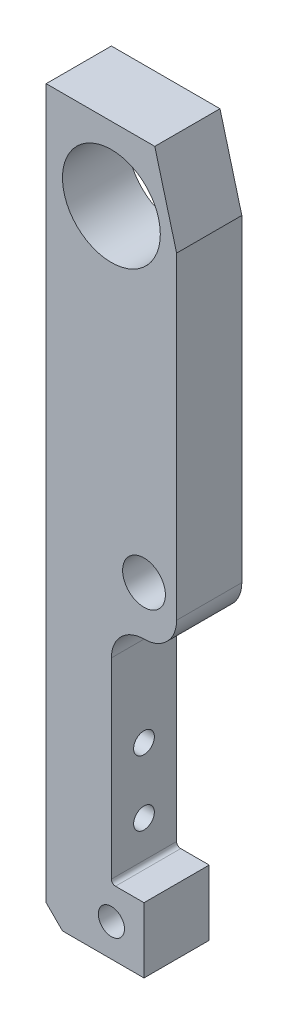
ISO-10303-21;
HEADER;
FILE_DESCRIPTION(('STEP AP214'),'2;1');
FILE_NAME('part.step','',(''),(''),'','','');
FILE_SCHEMA(('AUTOMOTIVE_DESIGN { 1 0 10303 214 1 1 1 1 }'));
ENDSEC;
DATA;
#1=APPLICATION_CONTEXT('core data for automotive mechanical design processes');
#2=APPLICATION_PROTOCOL_DEFINITION('international standard','automotive_design',2000,#1);
#3=PRODUCT_CONTEXT('',#1,'mechanical');
#4=PRODUCT('Part','Part','',(#3));
#5=PRODUCT_RELATED_PRODUCT_CATEGORY('part','',(#4));
#6=PRODUCT_DEFINITION_FORMATION('','',#4);
#7=PRODUCT_DEFINITION_CONTEXT('part definition',#1,'design');
#8=PRODUCT_DEFINITION('design','',#6,#7);
#9=PRODUCT_DEFINITION_SHAPE('','',#8);
#10=(LENGTH_UNIT() NAMED_UNIT(*) SI_UNIT(.MILLI.,.METRE.));
#11=(NAMED_UNIT(*) PLANE_ANGLE_UNIT() SI_UNIT($,.RADIAN.));
#12=(NAMED_UNIT(*) SI_UNIT($,.STERADIAN.) SOLID_ANGLE_UNIT());
#13=UNCERTAINTY_MEASURE_WITH_UNIT(LENGTH_MEASURE(1.E-05),#10,'distance_accuracy_value','');
#14=(GEOMETRIC_REPRESENTATION_CONTEXT(3) GLOBAL_UNCERTAINTY_ASSIGNED_CONTEXT((#13)) GLOBAL_UNIT_ASSIGNED_CONTEXT((#10,
#11,#12)) REPRESENTATION_CONTEXT('',''));
#15=CARTESIAN_POINT('',(0.,0.,0.));
#16=DIRECTION('',(0.,0.,1.));
#17=DIRECTION('',(1.,0.,0.));
#18=AXIS2_PLACEMENT_3D('',#15,#16,#17);
#19=CARTESIAN_POINT('',(12.7,70.6437500000002,6.34999999999999));
#20=DIRECTION('',(-1.,0.,0.));
#21=DIRECTION('',(0.,-1.,0.));
#22=AXIS2_PLACEMENT_3D('',#19,#20,#21);
#23=PLANE('',#22);
#24=DIRECTION('',(0.,1.,0.));
#25=VECTOR('',#24,1.);
#26=CARTESIAN_POINT('',(12.7,70.6437500000002,6.34999999999999));
#27=LINE('',#26,#25);
#28=CARTESIAN_POINT('',(12.7,-7.14374999999996,6.34999999999999));
#29=VERTEX_POINT('',#28);
#30=CARTESIAN_POINT('',(12.6999999999999,54.7687499999999,6.34999999999999));
#31=VERTEX_POINT('',#30);
#32=EDGE_CURVE('E193',#29,#31,#27,.T.);
#33=ORIENTED_EDGE('',*,*,#32,.F.);
#34=DIRECTION('',(0.,0.,1.));
#35=VECTOR('',#34,1.);
#36=CARTESIAN_POINT('',(12.7,-7.14374999999996,6.34999999999999));
#37=LINE('',#36,#35);
#38=CARTESIAN_POINT('',(12.7,-7.14374999999996,-6.35));
#39=VERTEX_POINT('',#38);
#40=EDGE_CURVE('E229',#29,#39,#37,.F.);
#41=ORIENTED_EDGE('',*,*,#40,.T.);
#42=DIRECTION('',(0.,1.,0.));
#43=VECTOR('',#42,1.);
#44=CARTESIAN_POINT('',(12.7,70.6437500000002,-6.35));
#45=LINE('',#44,#43);
#46=CARTESIAN_POINT('',(12.6999999999999,54.7687499999999,-6.35));
#47=VERTEX_POINT('',#46);
#48=EDGE_CURVE('E192',#39,#47,#45,.T.);
#49=ORIENTED_EDGE('',*,*,#48,.T.);
#50=DIRECTION('',(0.,0.,1.));
#51=VECTOR('',#50,1.);
#52=CARTESIAN_POINT('',(12.6999999999999,54.7687499999999,6.34999999999999));
#53=LINE('',#52,#51);
#54=EDGE_CURVE('E217',#47,#31,#53,.T.);
#55=ORIENTED_EDGE('',*,*,#54,.T.);
#56=EDGE_LOOP('',(#33,#41,#49,#55));
#57=FACE_BOUND('',#56,.T.);
#58=ADVANCED_FACE('F40',(#57),#23,.F.);
#59=CARTESIAN_POINT('',(-12.7,70.6437500000001,6.34999999999999));
#60=DIRECTION('',(0.,-1.,0.));
#61=DIRECTION('',(0.,0.,-1.));
#62=AXIS2_PLACEMENT_3D('',#59,#60,#61);
#63=PLANE('',#62);
#64=DIRECTION('',(-1.,0.,0.));
#65=VECTOR('',#64,1.);
#66=CARTESIAN_POINT('',(-12.7,70.6437500000001,6.34999999999999));
#67=LINE('',#66,#65);
#68=CARTESIAN_POINT('',(8.44630657015594,70.6437500000002,6.34999999999999));
#69=VERTEX_POINT('',#68);
#70=CARTESIAN_POINT('',(-12.7,70.6437500000001,6.34999999999999));
#71=VERTEX_POINT('',#70);
#72=EDGE_CURVE('E195',#69,#71,#67,.T.);
#73=ORIENTED_EDGE('',*,*,#72,.F.);
#74=DIRECTION('',(0.,0.,-1.));
#75=VECTOR('',#74,1.);
#76=CARTESIAN_POINT('',(8.44630657015594,70.6437500000002,6.34999999999999));
#77=LINE('',#76,#75);
#78=CARTESIAN_POINT('',(8.44630657015594,70.6437500000002,-6.35));
#79=VERTEX_POINT('',#78);
#80=EDGE_CURVE('E211',#69,#79,#77,.T.);
#81=ORIENTED_EDGE('',*,*,#80,.T.);
#82=DIRECTION('',(-1.,0.,0.));
#83=VECTOR('',#82,1.);
#84=CARTESIAN_POINT('',(-12.7,70.6437500000001,-6.35));
#85=LINE('',#84,#83);
#86=CARTESIAN_POINT('',(-12.7,70.6437500000001,-6.35));
#87=VERTEX_POINT('',#86);
#88=EDGE_CURVE('E204',#79,#87,#85,.T.);
#89=ORIENTED_EDGE('',*,*,#88,.T.);
#90=DIRECTION('',(0.,0.,-1.));
#91=VECTOR('',#90,1.);
#92=CARTESIAN_POINT('',(-12.7,70.6437500000001,6.34999999999999));
#93=LINE('',#92,#91);
#94=EDGE_CURVE('E202',#71,#87,#93,.T.);
#95=ORIENTED_EDGE('',*,*,#94,.F.);
#96=EDGE_LOOP('',(#73,#81,#89,#95));
#97=FACE_BOUND('',#96,.T.);
#98=ADVANCED_FACE('F257',(#97),#63,.F.);
#99=CARTESIAN_POINT('',(-12.7,70.6437500000001,6.34999999999999));
#100=DIRECTION('',(1.,0.,0.));
#101=DIRECTION('',(0.,1.,0.));
#102=AXIS2_PLACEMENT_3D('',#99,#100,#101);
#103=PLANE('',#102);
#104=CARTESIAN_POINT('',(-12.7,-50.00625,0.));
#105=DIRECTION('',(-1.,0.,0.));
#106=DIRECTION('',(0.,0.,1.));
#107=AXIS2_PLACEMENT_3D('',#104,#105,#106);
#108=CIRCLE('',#107,2.01929999999999);
#109=CARTESIAN_POINT('',(-12.7,-50.00625,2.01929999999999));
#110=VERTEX_POINT('',#109);
#111=EDGE_CURVE('E331',#110,#110,#108,.T.);
#112=ORIENTED_EDGE('',*,*,#111,.F.);
#113=EDGE_LOOP('',(#112));
#114=FACE_BOUND('',#113,.T.);
#115=CARTESIAN_POINT('',(-12.7,-37.30625,0.));
#116=DIRECTION('',(-1.,0.,0.));
#117=DIRECTION('',(0.,0.,1.));
#118=AXIS2_PLACEMENT_3D('',#115,#116,#117);
#119=CIRCLE('',#118,2.01929999999999);
#120=CARTESIAN_POINT('',(-12.7,-37.30625,2.01929999999999));
#121=VERTEX_POINT('',#120);
#122=EDGE_CURVE('E227',#121,#121,#119,.T.);
#123=ORIENTED_EDGE('',*,*,#122,.F.);
#124=EDGE_LOOP('',(#123));
#125=FACE_BOUND('',#124,.T.);
#126=DIRECTION('',(0.,-1.,0.));
#127=VECTOR('',#126,1.);
#128=CARTESIAN_POINT('',(-12.7,70.6437500000001,-6.35));
#129=LINE('',#128,#127);
#130=CARTESIAN_POINT('',(-12.7,-67.4687500000001,-6.35));
#131=VERTEX_POINT('',#130);
#132=EDGE_CURVE('E206',#87,#131,#129,.T.);
#133=ORIENTED_EDGE('',*,*,#132,.T.);
#134=DIRECTION('',(0.,0.,1.));
#135=VECTOR('',#134,1.);
#136=CARTESIAN_POINT('',(-12.7,-67.4687500000001,6.34999999999999));
#137=LINE('',#136,#135);
#138=CARTESIAN_POINT('',(-12.7,-67.4687500000001,6.34999999999999));
#139=VERTEX_POINT('',#138);
#140=EDGE_CURVE('E48',#131,#139,#137,.T.);
#141=ORIENTED_EDGE('',*,*,#140,.T.);
#142=DIRECTION('',(0.,-1.,0.));
#143=VECTOR('',#142,1.);
#144=CARTESIAN_POINT('',(-12.7,70.6437500000001,6.34999999999999));
#145=LINE('',#144,#143);
#146=EDGE_CURVE('E198',#71,#139,#145,.T.);
#147=ORIENTED_EDGE('',*,*,#146,.F.);
#148=ORIENTED_EDGE('',*,*,#94,.T.);
#149=EDGE_LOOP('',(#133,#141,#147,#148));
#150=FACE_BOUND('',#149,.T.);
#151=ADVANCED_FACE('F263',(#114,#125,#150),#103,.F.);
#152=CARTESIAN_POINT('',(-12.7,-70.6437500000001,6.34999999999999));
#153=DIRECTION('',(0.,1.,0.));
#154=DIRECTION('',(0.,0.,1.));
#155=AXIS2_PLACEMENT_3D('',#152,#153,#154);
#156=PLANE('',#155);
#157=DIRECTION('',(1.,0.,0.));
#158=VECTOR('',#157,1.);
#159=CARTESIAN_POINT('',(-12.7,-70.6437500000001,6.34999999999999));
#160=LINE('',#159,#158);
#161=CARTESIAN_POINT('',(-9.52499999999995,-70.6437500000001,6.34999999999999));
#162=VERTEX_POINT('',#161);
#163=CARTESIAN_POINT('',(6.35000000000002,-70.6437500000001,6.34999999999998));
#164=VERTEX_POINT('',#163);
#165=EDGE_CURVE('E200',#162,#164,#160,.T.);
#166=ORIENTED_EDGE('',*,*,#165,.F.);
#167=DIRECTION('',(0.,0.,-1.));
#168=VECTOR('',#167,1.);
#169=CARTESIAN_POINT('',(-9.52499999999995,-70.6437500000001,6.34999999999999));
#170=LINE('',#169,#168);
#171=CARTESIAN_POINT('',(-9.52499999999995,-70.6437500000001,-6.35));
#172=VERTEX_POINT('',#171);
#173=EDGE_CURVE('E233',#162,#172,#170,.T.);
#174=ORIENTED_EDGE('',*,*,#173,.T.);
#175=DIRECTION('',(1.,0.,0.));
#176=VECTOR('',#175,1.);
#177=CARTESIAN_POINT('',(-12.7,-70.6437500000001,-6.35));
#178=LINE('',#177,#176);
#179=CARTESIAN_POINT('',(6.35000000000002,-70.6437500000001,-6.35));
#180=VERTEX_POINT('',#179);
#181=EDGE_CURVE('E196',#172,#180,#178,.T.);
#182=ORIENTED_EDGE('',*,*,#181,.T.);
#183=DIRECTION('',(0.,0.,1.));
#184=VECTOR('',#183,1.);
#185=CARTESIAN_POINT('',(6.35000000000002,-70.6437500000001,-6.35100000000001));
#186=LINE('',#185,#184);
#187=EDGE_CURVE('E183',#180,#164,#186,.T.);
#188=ORIENTED_EDGE('',*,*,#187,.T.);
#189=EDGE_LOOP('',(#166,#174,#182,#188));
#190=FACE_BOUND('',#189,.T.);
#191=ADVANCED_FACE('F239',(#190),#156,.F.);
#192=CARTESIAN_POINT('',(12.7000000000001,-70.6437500000001,6.34999999999999));
#193=DIRECTION('',(0.,0.,1.));
#194=DIRECTION('',(1.,0.,0.));
#195=AXIS2_PLACEMENT_3D('',#192,#193,#194);
#196=PLANE('',#195);
#197=CARTESIAN_POINT('',(0.,-64.2937500000001,6.34999999999998));
#198=DIRECTION('',(0.,0.,1.));
#199=DIRECTION('',(1.,0.,0.));
#200=AXIS2_PLACEMENT_3D('',#197,#198,#199);
#201=CIRCLE('',#200,2.5527);
#202=CARTESIAN_POINT('',(2.55270000000006,-64.2937500000001,6.34999999999998));
#203=VERTEX_POINT('',#202);
#204=EDGE_CURVE('E226',#203,#203,#201,.T.);
#205=ORIENTED_EDGE('',*,*,#204,.F.);
#206=EDGE_LOOP('',(#205));
#207=FACE_BOUND('',#206,.T.);
#208=CARTESIAN_POINT('',(6.35000000000002,-3.96874999999997,6.34999999999999));
#209=DIRECTION('',(0.,0.,1.));
#210=DIRECTION('',(1.,0.,0.));
#211=AXIS2_PLACEMENT_3D('',#208,#209,#210);
#212=CIRCLE('',#211,4.167251);
#213=CARTESIAN_POINT('',(10.517251,-3.96874999999997,6.34999999999999));
#214=VERTEX_POINT('',#213);
#215=EDGE_CURVE('E345',#214,#214,#212,.T.);
#216=ORIENTED_EDGE('',*,*,#215,.F.);
#217=EDGE_LOOP('',(#216));
#218=FACE_BOUND('',#217,.T.);
#219=ORIENTED_EDGE('',*,*,#146,.T.);
#220=DIRECTION('',(-0.707106781186549,0.707106781186548,0.));
#221=VECTOR('',#220,1.);
#222=CARTESIAN_POINT('',(1.58750000000002,-81.7562500000001,6.34999999999999));
#223=LINE('',#222,#221);
#224=EDGE_CURVE('E11',#139,#162,#223,.F.);
#225=ORIENTED_EDGE('',*,*,#224,.T.);
#226=ORIENTED_EDGE('',*,*,#165,.T.);
#227=DIRECTION('',(0.,-1.,0.));
#228=VECTOR('',#227,1.);
#229=CARTESIAN_POINT('',(6.35000000000002,-57.94375,6.34999999999998));
#230=LINE('',#229,#228);
#231=CARTESIAN_POINT('',(6.35000000000002,-57.94375,6.34999999999998));
#232=VERTEX_POINT('',#231);
#233=EDGE_CURVE('E169',#232,#164,#230,.T.);
#234=ORIENTED_EDGE('',*,*,#233,.F.);
#235=DIRECTION('',(1.,0.,0.));
#236=VECTOR('',#235,1.);
#237=CARTESIAN_POINT('',(6.35000000000002,-57.94375,6.34999999999998));
#238=LINE('',#237,#236);
#239=CARTESIAN_POINT('',(0.793750000000037,-57.94375,6.34999999999998));
#240=VERTEX_POINT('',#239);
#241=EDGE_CURVE('E167',#240,#232,#238,.T.);
#242=ORIENTED_EDGE('',*,*,#241,.F.);
#243=CARTESIAN_POINT('',(0.793749999999982,-57.15,6.34999999999998));
#244=DIRECTION('',(0.,0.,1.));
#245=DIRECTION('',(1.,0.,0.));
#246=AXIS2_PLACEMENT_3D('',#243,#244,#245);
#247=CIRCLE('',#246,0.793750000000005);
#248=CARTESIAN_POINT('',(1.11022302462516E-13,-57.15,6.34999999999998));
#249=VERTEX_POINT('',#248);
#250=EDGE_CURVE('E136',#249,#240,#247,.T.);
#251=ORIENTED_EDGE('',*,*,#250,.F.);
#252=DIRECTION('',(0.,-1.,0.));
#253=VECTOR('',#252,1.);
#254=CARTESIAN_POINT('',(1.11022302462516E-13,-57.15,6.34999999999998));
#255=LINE('',#254,#253);
#256=CARTESIAN_POINT('',(0.,-19.84375,6.34999999999998));
#257=VERTEX_POINT('',#256);
#258=EDGE_CURVE('E141',#257,#249,#255,.T.);
#259=ORIENTED_EDGE('',*,*,#258,.F.);
#260=CARTESIAN_POINT('',(6.35000000000002,-19.84375,6.34999999999999));
#261=DIRECTION('',(0.,0.,1.));
#262=DIRECTION('',(1.,0.,0.));
#263=AXIS2_PLACEMENT_3D('',#260,#261,#262);
#264=CIRCLE('',#263,6.35);
#265=CARTESIAN_POINT('',(6.35000000000002,-13.49375,6.34999999999999));
#266=VERTEX_POINT('',#265);
#267=EDGE_CURVE('E172',#266,#257,#264,.T.);
#268=ORIENTED_EDGE('',*,*,#267,.F.);
#269=CARTESIAN_POINT('',(6.34999999999997,-7.14374999999996,6.34999999999999));
#270=DIRECTION('',(0.,0.,1.));
#271=DIRECTION('',(1.,0.,0.));
#272=AXIS2_PLACEMENT_3D('',#269,#270,#271);
#273=CIRCLE('',#272,6.35);
#274=EDGE_CURVE('E222',#266,#29,#273,.T.);
#275=ORIENTED_EDGE('',*,*,#274,.T.);
#276=ORIENTED_EDGE('',*,*,#32,.T.);
#277=DIRECTION('',(0.258819045102518,-0.965925826289071,0.));
#278=VECTOR('',#277,1.);
#279=CARTESIAN_POINT('',(44.0531249999997,-62.2427054760582,6.34999999999999));
#280=LINE('',#279,#278);
#281=EDGE_CURVE('E220',#31,#69,#280,.F.);
#282=ORIENTED_EDGE('',*,*,#281,.T.);
#283=ORIENTED_EDGE('',*,*,#72,.T.);
#284=EDGE_LOOP('',(#219,#225,#226,#234,#242,#251,#259,#268,#275,#276,#282,#283));
#285=FACE_BOUND('',#284,.T.);
#286=CARTESIAN_POINT('',(0.,56.3562500000001,6.34999999999999));
#287=DIRECTION('',(0.,0.,1.));
#288=DIRECTION('',(1.,0.,0.));
#289=AXIS2_PLACEMENT_3D('',#286,#287,#288);
#290=CIRCLE('',#289,9.525);
#291=CARTESIAN_POINT('',(9.52500000000007,56.3562500000001,6.34999999999999));
#292=VERTEX_POINT('',#291);
#293=EDGE_CURVE('E148',#292,#292,#290,.T.);
#294=ORIENTED_EDGE('',*,*,#293,.F.);
#295=EDGE_LOOP('',(#294));
#296=FACE_BOUND('',#295,.T.);
#297=ADVANCED_FACE('F247',(#207,#218,#285,#296),#196,.T.);
#298=CARTESIAN_POINT('',(12.7000000000001,-70.6437500000001,-6.35));
#299=DIRECTION('',(0.,0.,1.));
#300=DIRECTION('',(1.,0.,0.));
#301=AXIS2_PLACEMENT_3D('',#298,#299,#300);
#302=PLANE('',#301);
#303=CARTESIAN_POINT('',(1.11022302462516E-13,-64.2937500000001,-6.35));
#304=DIRECTION('',(0.,0.,1.));
#305=DIRECTION('',(1.,0.,0.));
#306=AXIS2_PLACEMENT_3D('',#303,#304,#305);
#307=CIRCLE('',#306,2.5527);
#308=CARTESIAN_POINT('',(2.55270000000011,-64.2937500000001,-6.35));
#309=VERTEX_POINT('',#308);
#310=EDGE_CURVE('E342',#309,#309,#307,.T.);
#311=ORIENTED_EDGE('',*,*,#310,.T.);
#312=EDGE_LOOP('',(#311));
#313=FACE_BOUND('',#312,.T.);
#314=CARTESIAN_POINT('',(6.35000000000002,-3.96874999999997,-6.35));
#315=DIRECTION('',(0.,0.,1.));
#316=DIRECTION('',(1.,0.,0.));
#317=AXIS2_PLACEMENT_3D('',#314,#315,#316);
#318=CIRCLE('',#317,4.167251);
#319=CARTESIAN_POINT('',(10.517251,-3.96874999999997,-6.35));
#320=VERTEX_POINT('',#319);
#321=EDGE_CURVE('E160',#320,#320,#318,.T.);
#322=ORIENTED_EDGE('',*,*,#321,.T.);
#323=EDGE_LOOP('',(#322));
#324=FACE_BOUND('',#323,.T.);
#325=ORIENTED_EDGE('',*,*,#181,.F.);
#326=DIRECTION('',(0.707106781186549,-0.707106781186548,0.));
#327=VECTOR('',#326,1.);
#328=CARTESIAN_POINT('',(-9.52499999999995,-70.6437500000001,-6.35));
#329=LINE('',#328,#327);
#330=EDGE_CURVE('E62',#172,#131,#329,.F.);
#331=ORIENTED_EDGE('',*,*,#330,.T.);
#332=ORIENTED_EDGE('',*,*,#132,.F.);
#333=ORIENTED_EDGE('',*,*,#88,.F.);
#334=DIRECTION('',(-0.258819045102518,0.965925826289071,0.));
#335=VECTOR('',#334,1.);
#336=CARTESIAN_POINT('',(8.44630657015594,70.6437500000002,-6.35));
#337=LINE('',#336,#335);
#338=EDGE_CURVE('E214',#79,#47,#337,.F.);
#339=ORIENTED_EDGE('',*,*,#338,.T.);
#340=ORIENTED_EDGE('',*,*,#48,.F.);
#341=CARTESIAN_POINT('',(6.34999999999997,-7.14374999999996,-6.35));
#342=DIRECTION('',(0.,0.,1.));
#343=DIRECTION('',(1.,0.,0.));
#344=AXIS2_PLACEMENT_3D('',#341,#342,#343);
#345=CIRCLE('',#344,6.35);
#346=CARTESIAN_POINT('',(6.35000000000002,-13.49375,-6.35));
#347=VERTEX_POINT('',#346);
#348=EDGE_CURVE('E231',#39,#347,#345,.F.);
#349=ORIENTED_EDGE('',*,*,#348,.T.);
#350=CARTESIAN_POINT('',(6.35000000000002,-19.84375,-6.35));
#351=DIRECTION('',(0.,0.,1.));
#352=DIRECTION('',(1.,0.,0.));
#353=AXIS2_PLACEMENT_3D('',#350,#351,#352);
#354=CIRCLE('',#353,6.35);
#355=CARTESIAN_POINT('',(1.11022302462516E-13,-19.84375,-6.35));
#356=VERTEX_POINT('',#355);
#357=EDGE_CURVE('E158',#356,#347,#354,.F.);
#358=ORIENTED_EDGE('',*,*,#357,.F.);
#359=DIRECTION('',(0.,1.,0.));
#360=VECTOR('',#359,1.);
#361=CARTESIAN_POINT('',(1.11022302462516E-13,-57.15,-6.35));
#362=LINE('',#361,#360);
#363=CARTESIAN_POINT('',(1.11022302462516E-13,-57.15,-6.35));
#364=VERTEX_POINT('',#363);
#365=EDGE_CURVE('E155',#364,#356,#362,.T.);
#366=ORIENTED_EDGE('',*,*,#365,.F.);
#367=CARTESIAN_POINT('',(0.793749999999982,-57.15,-6.35));
#368=DIRECTION('',(0.,0.,1.));
#369=DIRECTION('',(1.,0.,0.));
#370=AXIS2_PLACEMENT_3D('',#367,#368,#369);
#371=CIRCLE('',#370,0.793750000000005);
#372=CARTESIAN_POINT('',(0.793750000000037,-57.94375,-6.35));
#373=VERTEX_POINT('',#372);
#374=EDGE_CURVE('E133',#373,#364,#371,.F.);
#375=ORIENTED_EDGE('',*,*,#374,.F.);
#376=DIRECTION('',(-1.,0.,0.));
#377=VECTOR('',#376,1.);
#378=CARTESIAN_POINT('',(6.35000000000002,-57.94375,-6.35));
#379=LINE('',#378,#377);
#380=CARTESIAN_POINT('',(6.35000000000002,-57.94375,-6.35));
#381=VERTEX_POINT('',#380);
#382=EDGE_CURVE('E145',#381,#373,#379,.T.);
#383=ORIENTED_EDGE('',*,*,#382,.F.);
#384=DIRECTION('',(0.,1.,0.));
#385=VECTOR('',#384,1.);
#386=CARTESIAN_POINT('',(6.35000000000002,-57.94375,-6.35));
#387=LINE('',#386,#385);
#388=EDGE_CURVE('E156',#180,#381,#387,.T.);
#389=ORIENTED_EDGE('',*,*,#388,.F.);
#390=EDGE_LOOP('',(#325,#331,#332,#333,#339,#340,#349,#358,#366,#375,#383,#389));
#391=FACE_BOUND('',#390,.T.);
#392=CARTESIAN_POINT('',(0.,56.3562500000001,-6.35));
#393=DIRECTION('',(0.,0.,1.));
#394=DIRECTION('',(1.,0.,0.));
#395=AXIS2_PLACEMENT_3D('',#392,#393,#394);
#396=CIRCLE('',#395,9.525);
#397=CARTESIAN_POINT('',(9.52500000000007,56.3562500000001,-6.35));
#398=VERTEX_POINT('',#397);
#399=EDGE_CURVE('E189',#398,#398,#396,.F.);
#400=ORIENTED_EDGE('',*,*,#399,.F.);
#401=EDGE_LOOP('',(#400));
#402=FACE_BOUND('',#401,.T.);
#403=ADVANCED_FACE('F151',(#313,#324,#391,#402),#302,.F.);
#404=CARTESIAN_POINT('',(0.,56.3562500000001,-6.35100000000001));
#405=DIRECTION('',(0.,0.,1.));
#406=DIRECTION('',(1.,0.,0.));
#407=AXIS2_PLACEMENT_3D('',#404,#405,#406);
#408=CYLINDRICAL_SURFACE('',#407,9.525);
#409=ORIENTED_EDGE('',*,*,#293,.T.);
#410=EDGE_LOOP('',(#409));
#411=FACE_BOUND('',#410,.T.);
#412=ORIENTED_EDGE('',*,*,#399,.T.);
#413=EDGE_LOOP('',(#412));
#414=FACE_BOUND('',#413,.T.);
#415=ADVANCED_FACE('F298',(#411,#414),#408,.F.);
#416=CARTESIAN_POINT('',(0.793749999999982,-57.15,-6.35100000000001));
#417=DIRECTION('',(0.,0.,1.));
#418=DIRECTION('',(1.,0.,0.));
#419=AXIS2_PLACEMENT_3D('',#416,#417,#418);
#420=CYLINDRICAL_SURFACE('',#419,0.793750000000005);
#421=ORIENTED_EDGE('',*,*,#374,.T.);
#422=DIRECTION('',(0.,0.,1.));
#423=VECTOR('',#422,1.);
#424=CARTESIAN_POINT('',(1.11022302462516E-13,-57.15,-6.35100000000001));
#425=LINE('',#424,#423);
#426=EDGE_CURVE('E149',#364,#249,#425,.T.);
#427=ORIENTED_EDGE('',*,*,#426,.T.);
#428=ORIENTED_EDGE('',*,*,#250,.T.);
#429=DIRECTION('',(0.,0.,1.));
#430=VECTOR('',#429,1.);
#431=CARTESIAN_POINT('',(0.793750000000037,-57.94375,-6.35100000000001));
#432=LINE('',#431,#430);
#433=EDGE_CURVE('E129',#373,#240,#432,.T.);
#434=ORIENTED_EDGE('',*,*,#433,.F.);
#435=EDGE_LOOP('',(#421,#427,#428,#434));
#436=FACE_BOUND('',#435,.T.);
#437=ADVANCED_FACE('F131',(#436),#420,.F.);
#438=CARTESIAN_POINT('',(1.11022302462516E-13,-57.15,-6.35100000000001));
#439=DIRECTION('',(-1.,0.,0.));
#440=DIRECTION('',(0.,-1.,0.));
#441=AXIS2_PLACEMENT_3D('',#438,#439,#440);
#442=PLANE('',#441);
#443=CARTESIAN_POINT('',(1.11022302462516E-13,-50.00625,0.));
#444=DIRECTION('',(-1.,0.,0.));
#445=DIRECTION('',(0.,-1.,0.));
#446=AXIS2_PLACEMENT_3D('',#443,#444,#445);
#447=CIRCLE('',#446,2.01929999999999);
#448=CARTESIAN_POINT('',(1.11020113133069E-13,-52.02555,0.));
#449=VERTEX_POINT('',#448);
#450=EDGE_CURVE('E334',#449,#449,#447,.T.);
#451=ORIENTED_EDGE('',*,*,#450,.T.);
#452=EDGE_LOOP('',(#451));
#453=FACE_BOUND('',#452,.T.);
#454=CARTESIAN_POINT('',(0.,-37.30625,0.));
#455=DIRECTION('',(-1.,0.,0.));
#456=DIRECTION('',(0.,-1.,0.));
#457=AXIS2_PLACEMENT_3D('',#454,#455,#456);
#458=CIRCLE('',#457,2.01929999999999);
#459=CARTESIAN_POINT('',(0.,-39.32555,0.));
#460=VERTEX_POINT('',#459);
#461=EDGE_CURVE('E223',#460,#460,#458,.T.);
#462=ORIENTED_EDGE('',*,*,#461,.T.);
#463=EDGE_LOOP('',(#462));
#464=FACE_BOUND('',#463,.T.);
#465=ORIENTED_EDGE('',*,*,#365,.T.);
#466=DIRECTION('',(0.,0.,1.));
#467=VECTOR('',#466,1.);
#468=CARTESIAN_POINT('',(1.11022302462516E-13,-19.84375,-6.35100000000001));
#469=LINE('',#468,#467);
#470=EDGE_CURVE('E178',#356,#257,#469,.T.);
#471=ORIENTED_EDGE('',*,*,#470,.T.);
#472=ORIENTED_EDGE('',*,*,#258,.T.);
#473=ORIENTED_EDGE('',*,*,#426,.F.);
#474=EDGE_LOOP('',(#465,#471,#472,#473));
#475=FACE_BOUND('',#474,.T.);
#476=ADVANCED_FACE('F307',(#453,#464,#475),#442,.F.);
#477=CARTESIAN_POINT('',(6.35000000000002,-19.84375,-6.35100000000001));
#478=DIRECTION('',(0.,0.,1.));
#479=DIRECTION('',(1.,0.,0.));
#480=AXIS2_PLACEMENT_3D('',#477,#478,#479);
#481=CYLINDRICAL_SURFACE('',#480,6.35);
#482=ORIENTED_EDGE('',*,*,#357,.T.);
#483=DIRECTION('',(0.,0.,1.));
#484=VECTOR('',#483,1.);
#485=CARTESIAN_POINT('',(6.35000000000002,-13.49375,-6.35100000000001));
#486=LINE('',#485,#484);
#487=EDGE_CURVE('E180',#347,#266,#486,.T.);
#488=ORIENTED_EDGE('',*,*,#487,.T.);
#489=ORIENTED_EDGE('',*,*,#267,.T.);
#490=ORIENTED_EDGE('',*,*,#470,.F.);
#491=EDGE_LOOP('',(#482,#488,#489,#490));
#492=FACE_BOUND('',#491,.T.);
#493=ADVANCED_FACE('F311',(#492),#481,.F.);
#494=CARTESIAN_POINT('',(6.35000000000002,-57.94375,-6.35100000000001));
#495=DIRECTION('',(-1.,0.,0.));
#496=DIRECTION('',(0.,0.,1.));
#497=AXIS2_PLACEMENT_3D('',#494,#495,#496);
#498=PLANE('',#497);
#499=ORIENTED_EDGE('',*,*,#388,.T.);
#500=DIRECTION('',(0.,0.,1.));
#501=VECTOR('',#500,1.);
#502=CARTESIAN_POINT('',(6.35000000000002,-57.94375,-6.35100000000001));
#503=LINE('',#502,#501);
#504=EDGE_CURVE('E140',#381,#232,#503,.T.);
#505=ORIENTED_EDGE('',*,*,#504,.T.);
#506=ORIENTED_EDGE('',*,*,#233,.T.);
#507=ORIENTED_EDGE('',*,*,#187,.F.);
#508=EDGE_LOOP('',(#499,#505,#506,#507));
#509=FACE_BOUND('',#508,.T.);
#510=ADVANCED_FACE('F244',(#509),#498,.F.);
#511=CARTESIAN_POINT('',(6.35000000000002,-57.94375,-6.35100000000001));
#512=DIRECTION('',(0.,-1.,0.));
#513=DIRECTION('',(1.,0.,0.));
#514=AXIS2_PLACEMENT_3D('',#511,#512,#513);
#515=PLANE('',#514);
#516=ORIENTED_EDGE('',*,*,#382,.T.);
#517=ORIENTED_EDGE('',*,*,#433,.T.);
#518=ORIENTED_EDGE('',*,*,#241,.T.);
#519=ORIENTED_EDGE('',*,*,#504,.F.);
#520=EDGE_LOOP('',(#516,#517,#518,#519));
#521=FACE_BOUND('',#520,.T.);
#522=ADVANCED_FACE('F146',(#521),#515,.F.);
#523=CARTESIAN_POINT('',(8.44630657015594,70.6437500000002,6.34999999999999));
#524=DIRECTION('',(-0.965925826289071,-0.258819045102518,0.));
#525=DIRECTION('',(0.,0.,-1.));
#526=AXIS2_PLACEMENT_3D('',#523,#524,#525);
#527=PLANE('',#526);
#528=ORIENTED_EDGE('',*,*,#281,.F.);
#529=ORIENTED_EDGE('',*,*,#54,.F.);
#530=ORIENTED_EDGE('',*,*,#338,.F.);
#531=ORIENTED_EDGE('',*,*,#80,.F.);
#532=EDGE_LOOP('',(#528,#529,#530,#531));
#533=FACE_BOUND('',#532,.T.);
#534=ADVANCED_FACE('F269',(#533),#527,.F.);
#535=CARTESIAN_POINT('',(6.35000000000002,-3.96874999999997,6.34999999999999));
#536=DIRECTION('',(0.,0.,1.));
#537=DIRECTION('',(1.,0.,0.));
#538=AXIS2_PLACEMENT_3D('',#535,#536,#537);
#539=CYLINDRICAL_SURFACE('',#538,4.167251);
#540=ORIENTED_EDGE('',*,*,#321,.F.);
#541=EDGE_LOOP('',(#540));
#542=FACE_BOUND('',#541,.T.);
#543=ORIENTED_EDGE('',*,*,#215,.T.);
#544=EDGE_LOOP('',(#543));
#545=FACE_BOUND('',#544,.T.);
#546=ADVANCED_FACE('F271',(#542,#545),#539,.F.);
#547=CARTESIAN_POINT('',(0.,-64.2937500000001,6.34999999999998));
#548=DIRECTION('',(0.,0.,1.));
#549=DIRECTION('',(1.,0.,0.));
#550=AXIS2_PLACEMENT_3D('',#547,#548,#549);
#551=CYLINDRICAL_SURFACE('',#550,2.5527);
#552=ORIENTED_EDGE('',*,*,#310,.F.);
#553=EDGE_LOOP('',(#552));
#554=FACE_BOUND('',#553,.T.);
#555=ORIENTED_EDGE('',*,*,#204,.T.);
#556=EDGE_LOOP('',(#555));
#557=FACE_BOUND('',#556,.T.);
#558=ADVANCED_FACE('F277',(#554,#557),#551,.F.);
#559=CARTESIAN_POINT('',(-12.7,-37.30625,0.));
#560=DIRECTION('',(-1.,0.,0.));
#561=DIRECTION('',(0.,0.,1.));
#562=AXIS2_PLACEMENT_3D('',#559,#560,#561);
#563=CYLINDRICAL_SURFACE('',#562,2.01929999999999);
#564=ORIENTED_EDGE('',*,*,#122,.T.);
#565=EDGE_LOOP('',(#564));
#566=FACE_BOUND('',#565,.T.);
#567=ORIENTED_EDGE('',*,*,#461,.F.);
#568=EDGE_LOOP('',(#567));
#569=FACE_BOUND('',#568,.T.);
#570=ADVANCED_FACE('F320',(#566,#569),#563,.F.);
#571=CARTESIAN_POINT('',(-12.7,-50.00625,0.));
#572=DIRECTION('',(-1.,0.,0.));
#573=DIRECTION('',(0.,0.,1.));
#574=AXIS2_PLACEMENT_3D('',#571,#572,#573);
#575=CYLINDRICAL_SURFACE('',#574,2.01929999999999);
#576=ORIENTED_EDGE('',*,*,#111,.T.);
#577=EDGE_LOOP('',(#576));
#578=FACE_BOUND('',#577,.T.);
#579=ORIENTED_EDGE('',*,*,#450,.F.);
#580=EDGE_LOOP('',(#579));
#581=FACE_BOUND('',#580,.T.);
#582=ADVANCED_FACE('F254',(#578,#581),#575,.F.);
#583=CARTESIAN_POINT('',(6.34999999999997,-7.14374999999996,-6.35100000000001));
#584=DIRECTION('',(0.,0.,1.));
#585=DIRECTION('',(1.,0.,0.));
#586=AXIS2_PLACEMENT_3D('',#583,#584,#585);
#587=CYLINDRICAL_SURFACE('',#586,6.35);
#588=ORIENTED_EDGE('',*,*,#348,.F.);
#589=ORIENTED_EDGE('',*,*,#40,.F.);
#590=ORIENTED_EDGE('',*,*,#274,.F.);
#591=ORIENTED_EDGE('',*,*,#487,.F.);
#592=EDGE_LOOP('',(#588,#589,#590,#591));
#593=FACE_BOUND('',#592,.T.);
#594=ADVANCED_FACE('F250',(#593),#587,.T.);
#595=CARTESIAN_POINT('',(-9.52499999999995,-70.6437500000001,6.34999999999999));
#596=DIRECTION('',(0.707106781186548,0.707106781186549,0.));
#597=DIRECTION('',(0.,0.,-1.));
#598=AXIS2_PLACEMENT_3D('',#595,#596,#597);
#599=PLANE('',#598);
#600=ORIENTED_EDGE('',*,*,#224,.F.);
#601=ORIENTED_EDGE('',*,*,#140,.F.);
#602=ORIENTED_EDGE('',*,*,#330,.F.);
#603=ORIENTED_EDGE('',*,*,#173,.F.);
#604=EDGE_LOOP('',(#600,#601,#602,#603));
#605=FACE_BOUND('',#604,.T.);
#606=ADVANCED_FACE('F42',(#605),#599,.F.);
#607=CLOSED_SHELL('',(#58,#98,#151,#191,#297,#403,#415,#437,#476,#493,#510,#522,#534,#546,#558,
#570,#582,#594,#606));
#608=MANIFOLD_SOLID_BREP('B2',#607);
#609=ADVANCED_BREP_SHAPE_REPRESENTATION('',(#18,#608),#14);
#610=SHAPE_DEFINITION_REPRESENTATION(#9,#609);
ENDSEC;
END-ISO-10303-21;
